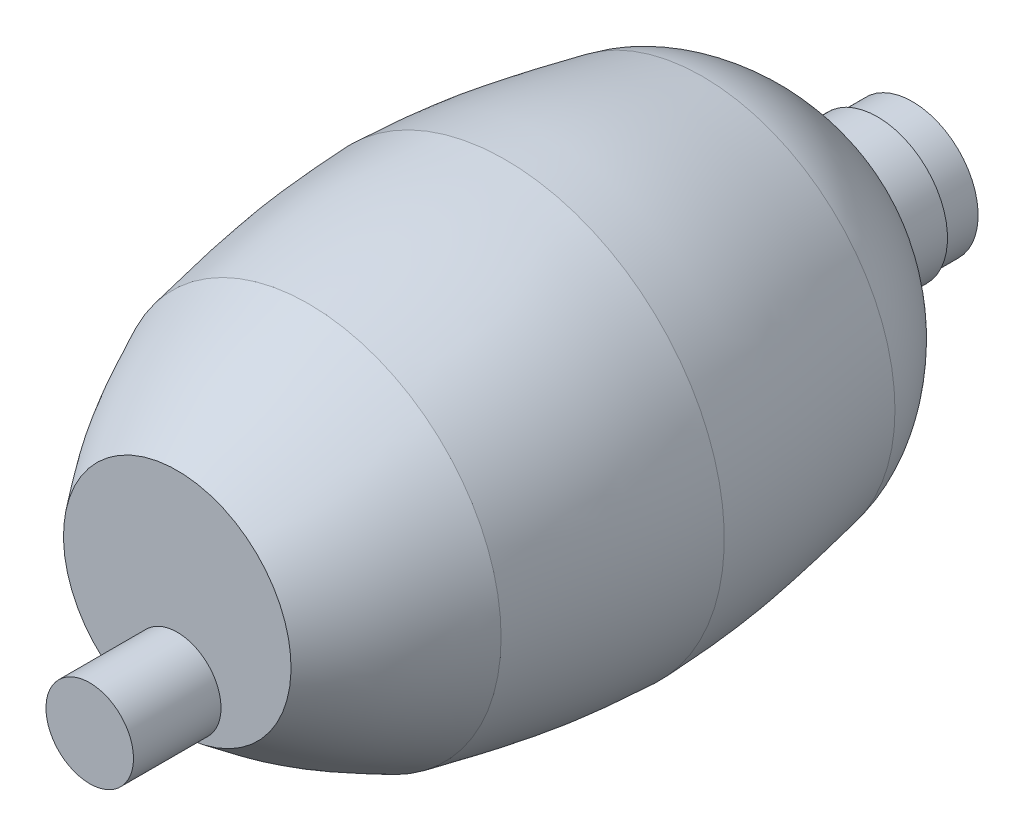
ISO-10303-21;
HEADER;
FILE_DESCRIPTION(('STEP AP214'),'2;1');
FILE_NAME('part.step','',(''),(''),'','','');
FILE_SCHEMA(('AUTOMOTIVE_DESIGN { 1 0 10303 214 1 1 1 1 }'));
ENDSEC;
DATA;
#1=APPLICATION_CONTEXT('core data for automotive mechanical design processes');
#2=APPLICATION_PROTOCOL_DEFINITION('international standard','automotive_design',2000,#1);
#3=PRODUCT_CONTEXT('',#1,'mechanical');
#4=PRODUCT('Part','Part','',(#3));
#5=PRODUCT_RELATED_PRODUCT_CATEGORY('part','',(#4));
#6=PRODUCT_DEFINITION_FORMATION('','',#4);
#7=PRODUCT_DEFINITION_CONTEXT('part definition',#1,'design');
#8=PRODUCT_DEFINITION('design','',#6,#7);
#9=PRODUCT_DEFINITION_SHAPE('','',#8);
#10=(LENGTH_UNIT() NAMED_UNIT(*) SI_UNIT(.MILLI.,.METRE.));
#11=(NAMED_UNIT(*) PLANE_ANGLE_UNIT() SI_UNIT($,.RADIAN.));
#12=(NAMED_UNIT(*) SI_UNIT($,.STERADIAN.) SOLID_ANGLE_UNIT());
#13=UNCERTAINTY_MEASURE_WITH_UNIT(LENGTH_MEASURE(1.E-05),#10,'distance_accuracy_value','');
#14=(GEOMETRIC_REPRESENTATION_CONTEXT(3) GLOBAL_UNCERTAINTY_ASSIGNED_CONTEXT((#13)) GLOBAL_UNIT_ASSIGNED_CONTEXT((#10,
#11,#12)) REPRESENTATION_CONTEXT('',''));
#15=CARTESIAN_POINT('',(0.,0.,0.));
#16=DIRECTION('',(0.,0.,1.));
#17=DIRECTION('',(1.,0.,0.));
#18=AXIS2_PLACEMENT_3D('',#15,#16,#17);
#19=CARTESIAN_POINT('',(0.,-0.0530477463289962,59.5377092094373));
#20=DIRECTION('',(0.,0.,-1.));
#21=DIRECTION('',(-1.,0.,0.));
#22=AXIS2_PLACEMENT_3D('',#19,#20,#21);
#23=PLANE('',#22);
#24=CARTESIAN_POINT('',(0.,-0.0530477463289962,59.5377092094373));
#25=DIRECTION('',(0.,0.,-1.));
#26=DIRECTION('',(-1.,0.,0.));
#27=AXIS2_PLACEMENT_3D('',#24,#25,#26);
#28=CIRCLE('',#27,20.6375);
#29=CARTESIAN_POINT('',(0.,-20.690547746329,59.5377092094373));
#30=VERTEX_POINT('',#29);
#31=EDGE_CURVE('E11',#30,#30,#28,.T.);
#32=ORIENTED_EDGE('',*,*,#31,.F.);
#33=CARTESIAN_POINT('',(0.,-12.753047746329,59.5377092094373));
#34=DIRECTION('',(0.,0.,1.));
#35=DIRECTION('',(1.,0.,0.));
#36=AXIS2_PLACEMENT_3D('',#33,#34,#35);
#37=CIRCLE('',#36,7.9375);
#38=EDGE_CURVE('E51',#30,#30,#37,.T.);
#39=ORIENTED_EDGE('',*,*,#38,.F.);
#40=EDGE_LOOP('',(#32,#39));
#41=FACE_BOUND('',#40,.T.);
#42=ADVANCED_FACE('F38',(#41),#23,.F.);
#43=CARTESIAN_POINT('',(11.90625,-0.0530477463289962,-73.8122907905627));
#44=DIRECTION('',(0.,0.,1.));
#45=DIRECTION('',(1.,0.,0.));
#46=AXIS2_PLACEMENT_3D('',#43,#44,#45);
#47=PLANE('',#46);
#48=CARTESIAN_POINT('',(0.,-0.0530477463289962,-73.8122907905627));
#49=DIRECTION('',(0.,0.,-1.));
#50=DIRECTION('',(-1.,0.,0.));
#51=AXIS2_PLACEMENT_3D('',#48,#49,#50);
#52=CIRCLE('',#51,11.90625);
#53=CARTESIAN_POINT('',(-11.9062500000001,-0.0530477463289962,-73.8122907905627));
#54=VERTEX_POINT('',#53);
#55=EDGE_CURVE('E169',#54,#54,#52,.T.);
#56=ORIENTED_EDGE('',*,*,#55,.T.);
#57=EDGE_LOOP('',(#56));
#58=FACE_BOUND('',#57,.T.);
#59=ADVANCED_FACE('F40',(#58),#47,.F.);
#60=CARTESIAN_POINT('',(20.6375,-0.0530477463289962,59.5377092094373));
#61=CARTESIAN_POINT('',(23.121459161979,-0.0530477463289962,56.249803259464));
#62=CARTESIAN_POINT('',(28.7284764022584,-0.0530477463289962,48.828044629894));
#63=CARTESIAN_POINT('',(32.7082833769349,-0.0530477463289962,40.4125589189418));
#64=CARTESIAN_POINT('',(34.925,-0.0530477463289962,35.7252092094374));
#65=B_SPLINE_CURVE_WITH_KNOTS('',3,(#60,#61,#62,#63,#64),.UNSPECIFIED.,.F.,.F.,(4,1,4),(0.,
0.443009010947021,1.),.UNSPECIFIED.);
#66=CARTESIAN_POINT('',(0.,-0.0530477463289962,-59.5247907905627));
#67=DIRECTION('',(0.,0.,-1.));
#68=AXIS1_PLACEMENT('',#66,#67);
#69=SURFACE_OF_REVOLUTION('',#65,#68);
#70=CARTESIAN_POINT('',(0.,-0.0530477463289962,35.7252092094374));
#71=DIRECTION('',(0.,0.,-1.));
#72=DIRECTION('',(-1.,0.,0.));
#73=AXIS2_PLACEMENT_3D('',#70,#71,#72);
#74=CIRCLE('',#73,34.925);
#75=CARTESIAN_POINT('',(-34.925,-0.0530477463289962,35.7252092094374));
#76=VERTEX_POINT('',#75);
#77=EDGE_CURVE('E46',#76,#76,#74,.T.);
#78=ORIENTED_EDGE('',*,*,#77,.F.);
#79=EDGE_LOOP('',(#78));
#80=FACE_BOUND('',#79,.T.);
#81=ORIENTED_EDGE('',*,*,#31,.T.);
#82=EDGE_LOOP('',(#81));
#83=FACE_BOUND('',#82,.T.);
#84=ADVANCED_FACE('F53',(#80,#83),#69,.T.);
#85=CARTESIAN_POINT('',(34.925,-0.0530477463289962,35.7252092094374));
#86=CARTESIAN_POINT('',(36.5114659357573,-0.0530477463289962,27.8183809719357));
#87=CARTESIAN_POINT('',(38.8821088794985,-0.0530477463289962,16.0032728463016));
#88=CARTESIAN_POINT('',(39.4873081637634,-0.0530477463289962,3.98270306708558));
#89=CARTESIAN_POINT('',(39.6875,-0.0530477463289962,0.00645920943734374));
#90=B_SPLINE_CURVE_WITH_KNOTS('',3,(#85,#86,#87,#88,#89),.UNSPECIFIED.,.F.,.F.,(4,1,4),(0.,
0.669213362537664,1.),.UNSPECIFIED.);
#91=CARTESIAN_POINT('',(0.,-0.0530477463289962,-59.5247907905627));
#92=DIRECTION('',(0.,0.,-1.));
#93=AXIS1_PLACEMENT('',#91,#92);
#94=SURFACE_OF_REVOLUTION('',#90,#93);
#95=CARTESIAN_POINT('',(0.,-0.0530477463289962,0.00645920943735242));
#96=DIRECTION('',(0.,0.,-1.));
#97=DIRECTION('',(-1.,0.,0.));
#98=AXIS2_PLACEMENT_3D('',#95,#96,#97);
#99=CIRCLE('',#98,39.6875);
#100=CARTESIAN_POINT('',(-39.6875,-0.0530477463289962,0.00645920943736457));
#101=VERTEX_POINT('',#100);
#102=EDGE_CURVE('E193',#101,#101,#99,.T.);
#103=ORIENTED_EDGE('',*,*,#102,.F.);
#104=EDGE_LOOP('',(#103));
#105=FACE_BOUND('',#104,.T.);
#106=ORIENTED_EDGE('',*,*,#77,.T.);
#107=EDGE_LOOP('',(#106));
#108=FACE_BOUND('',#107,.T.);
#109=ADVANCED_FACE('F55',(#105,#108),#94,.T.);
#110=CARTESIAN_POINT('',(39.6875,-0.0530477463289962,0.00645920943734374));
#111=CARTESIAN_POINT('',(39.4873081637634,-0.0530477463289962,-3.9697846482109));
#112=CARTESIAN_POINT('',(38.8821088794985,-0.0530477463289962,-15.9903544274269));
#113=CARTESIAN_POINT('',(36.5114659357573,-0.0530477463289962,-27.805462553061));
#114=CARTESIAN_POINT('',(34.925,-0.0530477463289962,-35.7122907905627));
#115=B_SPLINE_CURVE_WITH_KNOTS('',3,(#110,#111,#112,#113,#114),.UNSPECIFIED.,.F.,.F.,(4,1,4),
(0.,0.330786637462336,1.),.UNSPECIFIED.);
#116=CARTESIAN_POINT('',(0.,-0.0530477463289962,-59.5247907905627));
#117=DIRECTION('',(0.,0.,-1.));
#118=AXIS1_PLACEMENT('',#116,#117);
#119=SURFACE_OF_REVOLUTION('',#115,#118);
#120=CARTESIAN_POINT('',(0.,-0.0530477463289962,-35.7122907905626));
#121=DIRECTION('',(0.,0.,-1.));
#122=DIRECTION('',(-1.,0.,0.));
#123=AXIS2_PLACEMENT_3D('',#120,#121,#122);
#124=CIRCLE('',#123,34.925);
#125=CARTESIAN_POINT('',(-34.925,-0.0530477463289962,-35.7122907905626));
#126=VERTEX_POINT('',#125);
#127=EDGE_CURVE('E189',#126,#126,#124,.T.);
#128=ORIENTED_EDGE('',*,*,#127,.F.);
#129=EDGE_LOOP('',(#128));
#130=FACE_BOUND('',#129,.T.);
#131=ORIENTED_EDGE('',*,*,#102,.T.);
#132=EDGE_LOOP('',(#131));
#133=FACE_BOUND('',#132,.T.);
#134=ADVANCED_FACE('F62',(#130,#133),#119,.T.);
#135=CARTESIAN_POINT('',(34.925,-0.0530477463289962,-35.7122907905626));
#136=CARTESIAN_POINT('',(33.7971968536799,-0.0530477463289962,-41.3331777965042));
#137=CARTESIAN_POINT('',(26.6024416237151,-0.0530477463289962,-51.5000500598991));
#138=CARTESIAN_POINT('',(17.0399894399798,-0.0530477463289962,-57.0196703971602));
#139=CARTESIAN_POINT('',(12.7,-0.0530477463289962,-59.5247907905627));
#140=B_SPLINE_CURVE_WITH_KNOTS('',3,(#135,#136,#137,#138,#139),.UNSPECIFIED.,.F.,.F.,(4,1,4),
(0.,0.546142625699955,1.),.UNSPECIFIED.);
#141=CARTESIAN_POINT('',(0.,-0.0530477463289962,-59.5247907905627));
#142=DIRECTION('',(0.,0.,-1.));
#143=AXIS1_PLACEMENT('',#141,#142);
#144=SURFACE_OF_REVOLUTION('',#140,#143);
#145=CARTESIAN_POINT('',(0.,-0.0530477463289962,-59.5247907905627));
#146=DIRECTION('',(0.,0.,-1.));
#147=DIRECTION('',(-1.,0.,0.));
#148=AXIS2_PLACEMENT_3D('',#145,#146,#147);
#149=CIRCLE('',#148,12.7);
#150=CARTESIAN_POINT('',(-12.7,-0.0530477463289962,-59.5247907905626));
#151=VERTEX_POINT('',#150);
#152=EDGE_CURVE('E185',#151,#151,#149,.T.);
#153=ORIENTED_EDGE('',*,*,#152,.F.);
#154=EDGE_LOOP('',(#153));
#155=FACE_BOUND('',#154,.T.);
#156=ORIENTED_EDGE('',*,*,#127,.T.);
#157=EDGE_LOOP('',(#156));
#158=FACE_BOUND('',#157,.T.);
#159=ADVANCED_FACE('F94',(#155,#158),#144,.T.);
#160=CARTESIAN_POINT('',(0.,-0.0530477463289962,-59.5247907905627));
#161=DIRECTION('',(0.,0.,-1.));
#162=DIRECTION('',(-1.,0.,0.));
#163=AXIS2_PLACEMENT_3D('',#160,#161,#162);
#164=CYLINDRICAL_SURFACE('',#163,12.7);
#165=CARTESIAN_POINT('',(0.,-0.0530477463289962,-67.4622907905626));
#166=DIRECTION('',(0.,0.,-1.));
#167=DIRECTION('',(-1.,0.,0.));
#168=AXIS2_PLACEMENT_3D('',#165,#166,#167);
#169=CIRCLE('',#168,12.7);
#170=CARTESIAN_POINT('',(-12.7,-0.0530477463289962,-67.4622907905626));
#171=VERTEX_POINT('',#170);
#172=EDGE_CURVE('E181',#171,#171,#169,.T.);
#173=ORIENTED_EDGE('',*,*,#172,.F.);
#174=EDGE_LOOP('',(#173));
#175=FACE_BOUND('',#174,.T.);
#176=ORIENTED_EDGE('',*,*,#152,.T.);
#177=EDGE_LOOP('',(#176));
#178=FACE_BOUND('',#177,.T.);
#179=ADVANCED_FACE('F104',(#175,#178),#164,.T.);
#180=CARTESIAN_POINT('',(12.7,-0.0530477463289962,-67.4622907905627));
#181=DIRECTION('',(0.,0.,1.));
#182=DIRECTION('',(1.,0.,0.));
#183=AXIS2_PLACEMENT_3D('',#180,#181,#182);
#184=PLANE('',#183);
#185=CARTESIAN_POINT('',(0.,-0.0530477463289962,-67.4622907905627));
#186=DIRECTION('',(0.,0.,-1.));
#187=DIRECTION('',(-1.,0.,0.));
#188=AXIS2_PLACEMENT_3D('',#185,#186,#187);
#189=CIRCLE('',#188,11.90625);
#190=CARTESIAN_POINT('',(-11.90625,-0.0530477463289962,-67.4622907905627));
#191=VERTEX_POINT('',#190);
#192=EDGE_CURVE('E176',#191,#191,#189,.T.);
#193=ORIENTED_EDGE('',*,*,#192,.F.);
#194=EDGE_LOOP('',(#193));
#195=FACE_BOUND('',#194,.T.);
#196=ORIENTED_EDGE('',*,*,#172,.T.);
#197=EDGE_LOOP('',(#196));
#198=FACE_BOUND('',#197,.T.);
#199=ADVANCED_FACE('F114',(#195,#198),#184,.F.);
#200=CARTESIAN_POINT('',(0.,-0.0530477463289962,-59.5247907905627));
#201=DIRECTION('',(0.,0.,-1.));
#202=DIRECTION('',(-1.,0.,0.));
#203=AXIS2_PLACEMENT_3D('',#200,#201,#202);
#204=CYLINDRICAL_SURFACE('',#203,11.90625);
#205=ORIENTED_EDGE('',*,*,#55,.F.);
#206=EDGE_LOOP('',(#205));
#207=FACE_BOUND('',#206,.T.);
#208=ORIENTED_EDGE('',*,*,#192,.T.);
#209=EDGE_LOOP('',(#208));
#210=FACE_BOUND('',#209,.T.);
#211=ADVANCED_FACE('F124',(#207,#210),#204,.T.);
#212=CARTESIAN_POINT('',(0.,-12.753047746329,75.4127092094374));
#213=DIRECTION('',(0.,0.,-1.));
#214=DIRECTION('',(-1.,0.,0.));
#215=AXIS2_PLACEMENT_3D('',#212,#213,#214);
#216=CYLINDRICAL_SURFACE('',#215,7.9375);
#217=CARTESIAN_POINT('',(0.,-12.753047746329,75.4127092094374));
#218=DIRECTION('',(0.,0.,1.));
#219=DIRECTION('',(1.,0.,0.));
#220=AXIS2_PLACEMENT_3D('',#217,#218,#219);
#221=CIRCLE('',#220,7.9375);
#222=CARTESIAN_POINT('',(7.93750000000002,-12.753047746329,75.4127092094374));
#223=VERTEX_POINT('',#222);
#224=EDGE_CURVE('E177',#223,#223,#221,.T.);
#225=ORIENTED_EDGE('',*,*,#224,.F.);
#226=EDGE_LOOP('',(#225));
#227=FACE_BOUND('',#226,.T.);
#228=ORIENTED_EDGE('',*,*,#38,.T.);
#229=EDGE_LOOP('',(#228));
#230=FACE_BOUND('',#229,.T.);
#231=ADVANCED_FACE('F134',(#227,#230),#216,.T.);
#232=CARTESIAN_POINT('',(0.,-12.753047746329,75.4127092094374));
#233=DIRECTION('',(0.,0.,1.));
#234=DIRECTION('',(1.,0.,0.));
#235=AXIS2_PLACEMENT_3D('',#232,#233,#234);
#236=PLANE('',#235);
#237=ORIENTED_EDGE('',*,*,#224,.T.);
#238=EDGE_LOOP('',(#237));
#239=FACE_BOUND('',#238,.T.);
#240=ADVANCED_FACE('F144',(#239),#236,.T.);
#241=CLOSED_SHELL('',(#42,#59,#84,#109,#134,#159,#179,#199,#211,#231,#240));
#242=MANIFOLD_SOLID_BREP('B2',#241);
#243=ADVANCED_BREP_SHAPE_REPRESENTATION('',(#18,#242),#14);
#244=SHAPE_DEFINITION_REPRESENTATION(#9,#243);
ENDSEC;
END-ISO-10303-21;
